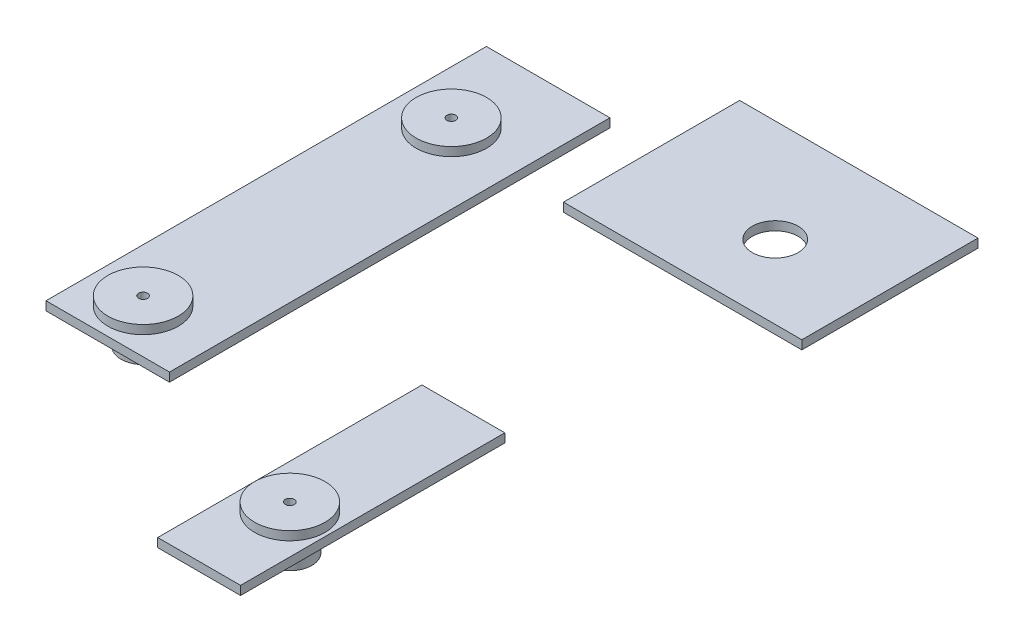
ISO-10303-21;
HEADER;
FILE_DESCRIPTION(('STEP AP214'),'2;1');
FILE_NAME('part.step','',(''),(''),'','','');
FILE_SCHEMA(('AUTOMOTIVE_DESIGN { 1 0 10303 214 1 1 1 1 }'));
ENDSEC;
DATA;
#1=APPLICATION_CONTEXT('core data for automotive mechanical design processes');
#2=APPLICATION_PROTOCOL_DEFINITION('international standard','automotive_design',2000,#1);
#3=PRODUCT_CONTEXT('',#1,'mechanical');
#4=PRODUCT('Part','Part','',(#3));
#5=PRODUCT_RELATED_PRODUCT_CATEGORY('part','',(#4));
#6=PRODUCT_DEFINITION_FORMATION('','',#4);
#7=PRODUCT_DEFINITION_CONTEXT('part definition',#1,'design');
#8=PRODUCT_DEFINITION('design','',#6,#7);
#9=PRODUCT_DEFINITION_SHAPE('','',#8);
#10=(LENGTH_UNIT() NAMED_UNIT(*) SI_UNIT(.MILLI.,.METRE.));
#11=(NAMED_UNIT(*) PLANE_ANGLE_UNIT() SI_UNIT($,.RADIAN.));
#12=(NAMED_UNIT(*) SI_UNIT($,.STERADIAN.) SOLID_ANGLE_UNIT());
#13=UNCERTAINTY_MEASURE_WITH_UNIT(LENGTH_MEASURE(1.E-05),#10,'distance_accuracy_value','');
#14=(GEOMETRIC_REPRESENTATION_CONTEXT(3) GLOBAL_UNCERTAINTY_ASSIGNED_CONTEXT((#13)) GLOBAL_UNIT_ASSIGNED_CONTEXT((#10,
#11,#12)) REPRESENTATION_CONTEXT('',''));
#15=CARTESIAN_POINT('',(0.,0.,0.));
#16=DIRECTION('',(0.,0.,1.));
#17=DIRECTION('',(1.,0.,0.));
#18=AXIS2_PLACEMENT_3D('',#15,#16,#17);
#19=CARTESIAN_POINT('',(-109.077805773511,45.2153525162861,-150.000000000001));
#20=DIRECTION('',(0.,1.,0.));
#21=DIRECTION('',(0.,0.,1.));
#22=AXIS2_PLACEMENT_3D('',#19,#20,#21);
#23=PLANE('',#22);
#24=CARTESIAN_POINT('',(-109.077805773511,45.2153525162861,-150.000000000001));
#25=DIRECTION('',(0.,1.,0.));
#26=DIRECTION('',(0.,0.,1.));
#27=AXIS2_PLACEMENT_3D('',#24,#25,#26);
#28=CIRCLE('',#27,5.09999999999999);
#29=CARTESIAN_POINT('',(-109.077805773511,45.2153525162862,-144.900000000001));
#30=VERTEX_POINT('',#29);
#31=EDGE_CURVE('E67',#30,#30,#28,.T.);
#32=ORIENTED_EDGE('',*,*,#31,.T.);
#33=EDGE_LOOP('',(#32));
#34=FACE_BOUND('',#33,.T.);
#35=CARTESIAN_POINT('',(-109.077805773511,45.2153525162861,-150.000000000001));
#36=DIRECTION('',(0.,-1.,0.));
#37=DIRECTION('',(0.,0.,-1.));
#38=AXIS2_PLACEMENT_3D('',#35,#36,#37);
#39=CIRCLE('',#38,25.);
#40=CARTESIAN_POINT('',(-109.077805773511,45.2153525162861,-175.000000000001));
#41=VERTEX_POINT('',#40);
#42=EDGE_CURVE('E11',#41,#41,#39,.T.);
#43=ORIENTED_EDGE('',*,*,#42,.T.);
#44=EDGE_LOOP('',(#43));
#45=FACE_BOUND('',#44,.T.);
#46=ADVANCED_FACE('F48',(#34,#45),#23,.F.);
#47=CARTESIAN_POINT('',(-109.077805773511,45.2153525162862,-150.000000000001));
#48=DIRECTION('',(0.,-1.,0.));
#49=DIRECTION('',(0.,0.,-1.));
#50=AXIS2_PLACEMENT_3D('',#47,#48,#49);
#51=CYLINDRICAL_SURFACE('',#50,25.);
#52=ORIENTED_EDGE('',*,*,#42,.F.);
#53=EDGE_LOOP('',(#52));
#54=FACE_BOUND('',#53,.T.);
#55=CARTESIAN_POINT('',(-109.077805773511,85.2153525162861,-150.000000000001));
#56=DIRECTION('',(0.,-1.,0.));
#57=DIRECTION('',(0.,0.,-1.));
#58=AXIS2_PLACEMENT_3D('',#55,#56,#57);
#59=CIRCLE('',#58,25.);
#60=CARTESIAN_POINT('',(-109.077805773511,85.215352516286,-175.000000000001));
#61=VERTEX_POINT('',#60);
#62=EDGE_CURVE('E54',#61,#61,#59,.T.);
#63=ORIENTED_EDGE('',*,*,#62,.T.);
#64=EDGE_LOOP('',(#63));
#65=FACE_BOUND('',#64,.T.);
#66=ADVANCED_FACE('F91',(#54,#65),#51,.T.);
#67=CARTESIAN_POINT('',(-109.077805773511,85.2153525162861,-125.000000000001));
#68=DIRECTION('',(0.,1.,0.));
#69=DIRECTION('',(0.,0.,1.));
#70=AXIS2_PLACEMENT_3D('',#67,#68,#69);
#71=PLANE('',#70);
#72=ORIENTED_EDGE('',*,*,#62,.F.);
#73=EDGE_LOOP('',(#72));
#74=FACE_BOUND('',#73,.T.);
#75=CARTESIAN_POINT('',(-109.077805773511,85.2153525162861,-150.000000000001));
#76=DIRECTION('',(0.,-1.,0.));
#77=DIRECTION('',(0.,0.,-1.));
#78=AXIS2_PLACEMENT_3D('',#75,#76,#77);
#79=CIRCLE('',#78,40.);
#80=CARTESIAN_POINT('',(-109.077805773511,85.215352516286,-190.000000000001));
#81=VERTEX_POINT('',#80);
#82=EDGE_CURVE('E58',#81,#81,#79,.T.);
#83=ORIENTED_EDGE('',*,*,#82,.T.);
#84=EDGE_LOOP('',(#83));
#85=FACE_BOUND('',#84,.T.);
#86=ADVANCED_FACE('F85',(#74,#85),#71,.F.);
#87=CARTESIAN_POINT('',(-109.077805773511,45.2153525162862,-150.000000000001));
#88=DIRECTION('',(0.,-1.,0.));
#89=DIRECTION('',(0.,0.,-1.));
#90=AXIS2_PLACEMENT_3D('',#87,#88,#89);
#91=CYLINDRICAL_SURFACE('',#90,40.);
#92=ORIENTED_EDGE('',*,*,#82,.F.);
#93=EDGE_LOOP('',(#92));
#94=FACE_BOUND('',#93,.T.);
#95=CARTESIAN_POINT('',(-109.077805773511,95.2153525162861,-150.000000000001));
#96=DIRECTION('',(0.,-1.,0.));
#97=DIRECTION('',(0.,0.,-1.));
#98=AXIS2_PLACEMENT_3D('',#95,#96,#97);
#99=CIRCLE('',#98,40.);
#100=CARTESIAN_POINT('',(-109.077805773511,95.215352516286,-190.000000000001));
#101=VERTEX_POINT('',#100);
#102=EDGE_CURVE('E62',#101,#101,#99,.T.);
#103=ORIENTED_EDGE('',*,*,#102,.T.);
#104=EDGE_LOOP('',(#103));
#105=FACE_BOUND('',#104,.T.);
#106=ADVANCED_FACE('F80',(#94,#105),#91,.T.);
#107=CARTESIAN_POINT('',(-109.077805773511,95.2153525162862,-110.000000000001));
#108=DIRECTION('',(0.,-1.,0.));
#109=DIRECTION('',(0.,0.,-1.));
#110=AXIS2_PLACEMENT_3D('',#107,#108,#109);
#111=PLANE('',#110);
#112=CARTESIAN_POINT('',(-109.077805773511,95.2153525162861,-150.000000000001));
#113=DIRECTION('',(0.,1.,0.));
#114=DIRECTION('',(0.,0.,1.));
#115=AXIS2_PLACEMENT_3D('',#112,#113,#114);
#116=CIRCLE('',#115,5.09999999999999);
#117=CARTESIAN_POINT('',(-109.077805773511,95.2153525162861,-144.900000000001));
#118=VERTEX_POINT('',#117);
#119=EDGE_CURVE('E70',#118,#118,#116,.T.);
#120=ORIENTED_EDGE('',*,*,#119,.F.);
#121=EDGE_LOOP('',(#120));
#122=FACE_BOUND('',#121,.T.);
#123=ORIENTED_EDGE('',*,*,#102,.F.);
#124=EDGE_LOOP('',(#123));
#125=FACE_BOUND('',#124,.T.);
#126=ADVANCED_FACE('F77',(#122,#125),#111,.F.);
#127=CARTESIAN_POINT('',(-109.077805773511,95.2153525162861,-150.000000000001));
#128=DIRECTION('',(0.,1.,0.));
#129=DIRECTION('',(0.,0.,1.));
#130=AXIS2_PLACEMENT_3D('',#127,#128,#129);
#131=CYLINDRICAL_SURFACE('',#130,5.09999999999999);
#132=ORIENTED_EDGE('',*,*,#119,.T.);
#133=EDGE_LOOP('',(#132));
#134=FACE_BOUND('',#133,.T.);
#135=ORIENTED_EDGE('',*,*,#31,.F.);
#136=EDGE_LOOP('',(#135));
#137=FACE_BOUND('',#136,.T.);
#138=ADVANCED_FACE('F74',(#134,#137),#131,.F.);
#139=CLOSED_SHELL('',(#46,#66,#86,#106,#126,#138));
#140=MANIFOLD_SOLID_BREP('B2',#139);
#141=CARTESIAN_POINT('',(-6.59194920871187E-13,-74.1841666666663,200.));
#142=DIRECTION('',(0.,-1.,0.));
#143=DIRECTION('',(1.,0.,0.));
#144=AXIS2_PLACEMENT_3D('',#141,#142,#143);
#145=PLANE('',#144);
#146=CARTESIAN_POINT('',(57.5251309112952,-74.1841666666671,200.));
#147=DIRECTION('',(0.,1.,0.));
#148=DIRECTION('',(0.,0.,1.));
#149=AXIS2_PLACEMENT_3D('',#146,#147,#148);
#150=CIRCLE('',#149,5.09999999999997);
#151=CARTESIAN_POINT('',(57.5251309112952,-74.1841666666671,205.1));
#152=VERTEX_POINT('',#151);
#153=EDGE_CURVE('E168',#152,#152,#150,.T.);
#154=ORIENTED_EDGE('',*,*,#153,.T.);
#155=EDGE_LOOP('',(#154));
#156=FACE_BOUND('',#155,.T.);
#157=CARTESIAN_POINT('',(57.5251309112946,-74.1841666666669,200.));
#158=DIRECTION('',(0.,-1.,0.));
#159=DIRECTION('',(1.,0.,0.));
#160=AXIS2_PLACEMENT_3D('',#157,#158,#159);
#161=CIRCLE('',#160,25.);
#162=CARTESIAN_POINT('',(82.5251309112947,-74.1841666666672,200.));
#163=VERTEX_POINT('',#162);
#164=EDGE_CURVE('E163',#163,#163,#161,.T.);
#165=ORIENTED_EDGE('',*,*,#164,.T.);
#166=EDGE_LOOP('',(#165));
#167=FACE_BOUND('',#166,.T.);
#168=ADVANCED_FACE('F149',(#156,#167),#145,.T.);
#169=CARTESIAN_POINT('',(-2.35922392732846E-13,-24.1841666666663,200.));
#170=DIRECTION('',(0.,1.,0.));
#171=DIRECTION('',(-1.,0.,0.));
#172=AXIS2_PLACEMENT_3D('',#169,#170,#171);
#173=PLANE('',#172);
#174=CARTESIAN_POINT('',(57.5251309112952,-24.1841666666669,200.));
#175=DIRECTION('',(0.,1.,0.));
#176=DIRECTION('',(0.,0.,1.));
#177=AXIS2_PLACEMENT_3D('',#174,#175,#176);
#178=CIRCLE('',#177,5.09999999999999);
#179=CARTESIAN_POINT('',(57.5251309112952,-24.1841666666669,205.1));
#180=VERTEX_POINT('',#179);
#181=EDGE_CURVE('E171',#180,#180,#178,.T.);
#182=ORIENTED_EDGE('',*,*,#181,.F.);
#183=EDGE_LOOP('',(#182));
#184=FACE_BOUND('',#183,.T.);
#185=CARTESIAN_POINT('',(57.5251309112952,-24.184166666667,200.));
#186=DIRECTION('',(0.,-1.,0.));
#187=DIRECTION('',(1.,0.,0.));
#188=AXIS2_PLACEMENT_3D('',#185,#186,#187);
#189=CIRCLE('',#188,40.);
#190=CARTESIAN_POINT('',(97.5251309112952,-24.1841666666674,200.));
#191=VERTEX_POINT('',#190);
#192=EDGE_CURVE('E47',#191,#191,#189,.T.);
#193=ORIENTED_EDGE('',*,*,#192,.F.);
#194=EDGE_LOOP('',(#193));
#195=FACE_BOUND('',#194,.T.);
#196=ADVANCED_FACE('F177',(#184,#195),#173,.T.);
#197=CARTESIAN_POINT('',(57.5251309112946,-74.1841666666669,200.));
#198=DIRECTION('',(0.,-1.,0.));
#199=DIRECTION('',(1.,0.,0.));
#200=AXIS2_PLACEMENT_3D('',#197,#198,#199);
#201=CYLINDRICAL_SURFACE('',#200,40.);
#202=ORIENTED_EDGE('',*,*,#192,.T.);
#203=EDGE_LOOP('',(#202));
#204=FACE_BOUND('',#203,.T.);
#205=CARTESIAN_POINT('',(57.5251309112951,-34.184166666667,200.));
#206=DIRECTION('',(0.,-1.,0.));
#207=DIRECTION('',(1.,0.,0.));
#208=AXIS2_PLACEMENT_3D('',#205,#206,#207);
#209=CIRCLE('',#208,40.);
#210=CARTESIAN_POINT('',(97.5251309112951,-34.1841666666674,200.));
#211=VERTEX_POINT('',#210);
#212=EDGE_CURVE('E155',#211,#211,#209,.T.);
#213=ORIENTED_EDGE('',*,*,#212,.F.);
#214=EDGE_LOOP('',(#213));
#215=FACE_BOUND('',#214,.T.);
#216=ADVANCED_FACE('F180',(#204,#215),#201,.T.);
#217=CARTESIAN_POINT('',(-3.81639164714898E-13,-34.1841666666663,200.));
#218=DIRECTION('',(0.,-1.,0.));
#219=DIRECTION('',(1.,0.,0.));
#220=AXIS2_PLACEMENT_3D('',#217,#218,#219);
#221=PLANE('',#220);
#222=ORIENTED_EDGE('',*,*,#212,.T.);
#223=EDGE_LOOP('',(#222));
#224=FACE_BOUND('',#223,.T.);
#225=CARTESIAN_POINT('',(57.5251309112951,-34.184166666667,200.));
#226=DIRECTION('',(0.,-1.,0.));
#227=DIRECTION('',(1.,0.,0.));
#228=AXIS2_PLACEMENT_3D('',#225,#226,#227);
#229=CIRCLE('',#228,25.);
#230=CARTESIAN_POINT('',(82.5251309112951,-34.1841666666672,200.));
#231=VERTEX_POINT('',#230);
#232=EDGE_CURVE('E159',#231,#231,#229,.T.);
#233=ORIENTED_EDGE('',*,*,#232,.F.);
#234=EDGE_LOOP('',(#233));
#235=FACE_BOUND('',#234,.T.);
#236=ADVANCED_FACE('F185',(#224,#235),#221,.T.);
#237=CARTESIAN_POINT('',(57.5251309112946,-74.1841666666669,200.));
#238=DIRECTION('',(0.,-1.,0.));
#239=DIRECTION('',(1.,0.,0.));
#240=AXIS2_PLACEMENT_3D('',#237,#238,#239);
#241=CYLINDRICAL_SURFACE('',#240,25.);
#242=ORIENTED_EDGE('',*,*,#232,.T.);
#243=EDGE_LOOP('',(#242));
#244=FACE_BOUND('',#243,.T.);
#245=ORIENTED_EDGE('',*,*,#164,.F.);
#246=EDGE_LOOP('',(#245));
#247=FACE_BOUND('',#246,.T.);
#248=ADVANCED_FACE('F191',(#244,#247),#241,.T.);
#249=CARTESIAN_POINT('',(57.5251309112952,-24.1841666666669,200.));
#250=DIRECTION('',(0.,1.,0.));
#251=DIRECTION('',(0.,0.,1.));
#252=AXIS2_PLACEMENT_3D('',#249,#250,#251);
#253=CYLINDRICAL_SURFACE('',#252,5.09999999999998);
#254=ORIENTED_EDGE('',*,*,#153,.F.);
#255=EDGE_LOOP('',(#254));
#256=FACE_BOUND('',#255,.T.);
#257=ORIENTED_EDGE('',*,*,#181,.T.);
#258=EDGE_LOOP('',(#257));
#259=FACE_BOUND('',#258,.T.);
#260=ADVANCED_FACE('F175',(#256,#259),#253,.F.);
#261=CLOSED_SHELL('',(#168,#196,#216,#236,#248,#260));
#262=MANIFOLD_SOLID_BREP('B6',#261);
#263=CARTESIAN_POINT('',(4.02455846426619E-13,45.2153525162862,200.));
#264=DIRECTION('',(0.,1.,0.));
#265=DIRECTION('',(0.,0.,1.));
#266=AXIS2_PLACEMENT_3D('',#263,#264,#265);
#267=PLANE('',#266);
#268=CARTESIAN_POINT('',(-109.077805773511,45.2153525162862,200.));
#269=DIRECTION('',(0.,1.,0.));
#270=DIRECTION('',(0.,0.,1.));
#271=AXIS2_PLACEMENT_3D('',#268,#269,#270);
#272=CIRCLE('',#271,5.09999999999999);
#273=CARTESIAN_POINT('',(-109.077805773511,45.2153525162862,205.1));
#274=VERTEX_POINT('',#273);
#275=EDGE_CURVE('E273',#274,#274,#272,.T.);
#276=ORIENTED_EDGE('',*,*,#275,.T.);
#277=EDGE_LOOP('',(#276));
#278=FACE_BOUND('',#277,.T.);
#279=CARTESIAN_POINT('',(-109.077805773511,45.2153525162863,200.));
#280=DIRECTION('',(0.,1.,0.));
#281=DIRECTION('',(0.,0.,1.));
#282=AXIS2_PLACEMENT_3D('',#279,#280,#281);
#283=CIRCLE('',#282,25.);
#284=CARTESIAN_POINT('',(-109.077805773511,45.2153525162863,225.));
#285=VERTEX_POINT('',#284);
#286=EDGE_CURVE('E268',#285,#285,#283,.T.);
#287=ORIENTED_EDGE('',*,*,#286,.F.);
#288=EDGE_LOOP('',(#287));
#289=FACE_BOUND('',#288,.T.);
#290=ADVANCED_FACE('F254',(#278,#289),#267,.F.);
#291=CARTESIAN_POINT('',(9.29811783123569E-13,95.2153525162862,200.));
#292=DIRECTION('',(0.,-1.,0.));
#293=DIRECTION('',(0.,0.,-1.));
#294=AXIS2_PLACEMENT_3D('',#291,#292,#293);
#295=PLANE('',#294);
#296=CARTESIAN_POINT('',(-109.077805773511,95.2153525162862,200.));
#297=DIRECTION('',(0.,1.,0.));
#298=DIRECTION('',(0.,0.,1.));
#299=AXIS2_PLACEMENT_3D('',#296,#297,#298);
#300=CIRCLE('',#299,5.09999999999999);
#301=CARTESIAN_POINT('',(-109.077805773511,95.2153525162862,205.1));
#302=VERTEX_POINT('',#301);
#303=EDGE_CURVE('E276',#302,#302,#300,.T.);
#304=ORIENTED_EDGE('',*,*,#303,.F.);
#305=EDGE_LOOP('',(#304));
#306=FACE_BOUND('',#305,.T.);
#307=CARTESIAN_POINT('',(-109.077805773511,95.2153525162864,200.));
#308=DIRECTION('',(0.,1.,0.));
#309=DIRECTION('',(0.,0.,1.));
#310=AXIS2_PLACEMENT_3D('',#307,#308,#309);
#311=CIRCLE('',#310,39.9999999999994);
#312=CARTESIAN_POINT('',(-109.077805773511,95.2153525162864,239.999999999999));
#313=VERTEX_POINT('',#312);
#314=EDGE_CURVE('E148',#313,#313,#311,.T.);
#315=ORIENTED_EDGE('',*,*,#314,.T.);
#316=EDGE_LOOP('',(#315));
#317=FACE_BOUND('',#316,.T.);
#318=ADVANCED_FACE('F283',(#306,#317),#295,.F.);
#319=CARTESIAN_POINT('',(-109.077805773511,85.2153525162862,200.));
#320=DIRECTION('',(0.,1.,0.));
#321=DIRECTION('',(0.,0.,1.));
#322=AXIS2_PLACEMENT_3D('',#319,#320,#321);
#323=CYLINDRICAL_SURFACE('',#322,39.9999999999995);
#324=ORIENTED_EDGE('',*,*,#314,.F.);
#325=EDGE_LOOP('',(#324));
#326=FACE_BOUND('',#325,.T.);
#327=CARTESIAN_POINT('',(-109.077805773511,85.2153525162864,200.));
#328=DIRECTION('',(0.,1.,0.));
#329=DIRECTION('',(0.,0.,1.));
#330=AXIS2_PLACEMENT_3D('',#327,#328,#329);
#331=CIRCLE('',#330,39.9999999999996);
#332=CARTESIAN_POINT('',(-109.077805773511,85.2153525162864,240.));
#333=VERTEX_POINT('',#332);
#334=EDGE_CURVE('E260',#333,#333,#331,.T.);
#335=ORIENTED_EDGE('',*,*,#334,.T.);
#336=EDGE_LOOP('',(#335));
#337=FACE_BOUND('',#336,.T.);
#338=ADVANCED_FACE('F285',(#326,#337),#323,.T.);
#339=CARTESIAN_POINT('',(9.43689570931383E-13,85.2153525162863,200.));
#340=DIRECTION('',(0.,1.,0.));
#341=DIRECTION('',(0.,0.,1.));
#342=AXIS2_PLACEMENT_3D('',#339,#340,#341);
#343=PLANE('',#342);
#344=ORIENTED_EDGE('',*,*,#334,.F.);
#345=EDGE_LOOP('',(#344));
#346=FACE_BOUND('',#345,.T.);
#347=CARTESIAN_POINT('',(-109.077805773511,85.2153525162863,200.));
#348=DIRECTION('',(0.,1.,0.));
#349=DIRECTION('',(0.,0.,1.));
#350=AXIS2_PLACEMENT_3D('',#347,#348,#349);
#351=CIRCLE('',#350,24.9999999999995);
#352=CARTESIAN_POINT('',(-109.077805773511,85.2153525162863,225.));
#353=VERTEX_POINT('',#352);
#354=EDGE_CURVE('E264',#353,#353,#351,.T.);
#355=ORIENTED_EDGE('',*,*,#354,.T.);
#356=EDGE_LOOP('',(#355));
#357=FACE_BOUND('',#356,.T.);
#358=ADVANCED_FACE('F290',(#346,#357),#343,.F.);
#359=CARTESIAN_POINT('',(-109.077805773511,85.2153525162862,200.));
#360=DIRECTION('',(0.,1.,0.));
#361=DIRECTION('',(0.,0.,1.));
#362=AXIS2_PLACEMENT_3D('',#359,#360,#361);
#363=CYLINDRICAL_SURFACE('',#362,24.9999999999998);
#364=ORIENTED_EDGE('',*,*,#354,.F.);
#365=EDGE_LOOP('',(#364));
#366=FACE_BOUND('',#365,.T.);
#367=ORIENTED_EDGE('',*,*,#286,.T.);
#368=EDGE_LOOP('',(#367));
#369=FACE_BOUND('',#368,.T.);
#370=ADVANCED_FACE('F297',(#366,#369),#363,.T.);
#371=CARTESIAN_POINT('',(-109.077805773511,95.2153525162862,200.));
#372=DIRECTION('',(0.,1.,0.));
#373=DIRECTION('',(0.,0.,1.));
#374=AXIS2_PLACEMENT_3D('',#371,#372,#373);
#375=CYLINDRICAL_SURFACE('',#374,5.09999999999999);
#376=ORIENTED_EDGE('',*,*,#303,.T.);
#377=EDGE_LOOP('',(#376));
#378=FACE_BOUND('',#377,.T.);
#379=ORIENTED_EDGE('',*,*,#275,.F.);
#380=EDGE_LOOP('',(#379));
#381=FACE_BOUND('',#380,.T.);
#382=ADVANCED_FACE('F280',(#378,#381),#375,.F.);
#383=CLOSED_SHELL('',(#290,#318,#338,#358,#370,#382));
#384=MANIFOLD_SOLID_BREP('B42',#383);
#385=CARTESIAN_POINT('',(268.195509943439,315.915173578323,100.));
#386=DIRECTION('',(0.,1.,0.));
#387=DIRECTION('',(0.,0.,1.));
#388=AXIS2_PLACEMENT_3D('',#385,#386,#387);
#389=PLANE('',#388);
#390=CARTESIAN_POINT('',(425.006556805499,315.915173578323,16.4302576927184));
#391=DIRECTION('',(0.,1.,0.));
#392=DIRECTION('',(0.,0.,1.));
#393=AXIS2_PLACEMENT_3D('',#390,#391,#392);
#394=CIRCLE('',#393,25.9999999999999);
#395=CARTESIAN_POINT('',(425.006556805499,315.915173578323,42.4302576927184));
#396=VERTEX_POINT('',#395);
#397=EDGE_CURVE('E424',#396,#396,#394,.T.);
#398=ORIENTED_EDGE('',*,*,#397,.T.);
#399=EDGE_LOOP('',(#398));
#400=FACE_BOUND('',#399,.T.);
#401=DIRECTION('',(1.,0.,0.));
#402=VECTOR('',#401,1.);
#403=CARTESIAN_POINT('',(268.195509943439,315.915173578323,-100.));
#404=LINE('',#403,#402);
#405=CARTESIAN_POINT('',(268.195509943439,315.915173578323,-100.));
#406=VERTEX_POINT('',#405);
#407=CARTESIAN_POINT('',(538.815556412828,315.915173578323,-100.));
#408=VERTEX_POINT('',#407);
#409=EDGE_CURVE('E422',#406,#408,#404,.T.);
#410=ORIENTED_EDGE('',*,*,#409,.T.);
#411=DIRECTION('',(0.,0.,-1.));
#412=VECTOR('',#411,1.);
#413=CARTESIAN_POINT('',(538.815556412828,315.915173578323,100.));
#414=LINE('',#413,#412);
#415=CARTESIAN_POINT('',(538.815556412828,315.915173578323,100.));
#416=VERTEX_POINT('',#415);
#417=EDGE_CURVE('E252',#416,#408,#414,.T.);
#418=ORIENTED_EDGE('',*,*,#417,.F.);
#419=DIRECTION('',(1.,0.,0.));
#420=VECTOR('',#419,1.);
#421=CARTESIAN_POINT('',(268.195509943439,315.915173578323,100.));
#422=LINE('',#421,#420);
#423=CARTESIAN_POINT('',(268.195509943439,315.915173578323,100.));
#424=VERTEX_POINT('',#423);
#425=EDGE_CURVE('E399',#424,#416,#422,.T.);
#426=ORIENTED_EDGE('',*,*,#425,.F.);
#427=DIRECTION('',(0.,0.,-1.));
#428=VECTOR('',#427,1.);
#429=CARTESIAN_POINT('',(268.195509943439,315.915173578323,100.));
#430=LINE('',#429,#428);
#431=EDGE_CURVE('E375',#424,#406,#430,.T.);
#432=ORIENTED_EDGE('',*,*,#431,.T.);
#433=EDGE_LOOP('',(#410,#418,#426,#432));
#434=FACE_BOUND('',#433,.T.);
#435=ADVANCED_FACE('F359',(#400,#434),#389,.F.);
#436=CARTESIAN_POINT('',(538.815556412828,325.915173578323,100.));
#437=DIRECTION('',(1.,0.,0.));
#438=DIRECTION('',(0.,0.,-1.));
#439=AXIS2_PLACEMENT_3D('',#436,#437,#438);
#440=PLANE('',#439);
#441=DIRECTION('',(0.,-1.,0.));
#442=VECTOR('',#441,1.);
#443=CARTESIAN_POINT('',(538.815556412828,325.915173578323,-100.));
#444=LINE('',#443,#442);
#445=CARTESIAN_POINT('',(538.815556412828,325.915173578323,-100.));
#446=VERTEX_POINT('',#445);
#447=EDGE_CURVE('E408',#446,#408,#444,.T.);
#448=ORIENTED_EDGE('',*,*,#447,.F.);
#449=DIRECTION('',(0.,0.,-1.));
#450=VECTOR('',#449,1.);
#451=CARTESIAN_POINT('',(538.815556412828,325.915173578323,100.));
#452=LINE('',#451,#450);
#453=CARTESIAN_POINT('',(538.815556412828,325.915173578323,100.));
#454=VERTEX_POINT('',#453);
#455=EDGE_CURVE('E367',#454,#446,#452,.T.);
#456=ORIENTED_EDGE('',*,*,#455,.F.);
#457=DIRECTION('',(0.,-1.,0.));
#458=VECTOR('',#457,1.);
#459=CARTESIAN_POINT('',(538.815556412828,325.915173578323,100.));
#460=LINE('',#459,#458);
#461=EDGE_CURVE('E406',#454,#416,#460,.T.);
#462=ORIENTED_EDGE('',*,*,#461,.T.);
#463=ORIENTED_EDGE('',*,*,#417,.T.);
#464=EDGE_LOOP('',(#448,#456,#462,#463));
#465=FACE_BOUND('',#464,.T.);
#466=ADVANCED_FACE('F405',(#465),#440,.T.);
#467=CARTESIAN_POINT('',(268.195509943439,325.915173578323,100.));
#468=DIRECTION('',(0.,1.,0.));
#469=DIRECTION('',(0.,0.,1.));
#470=AXIS2_PLACEMENT_3D('',#467,#468,#469);
#471=PLANE('',#470);
#472=CARTESIAN_POINT('',(425.006556805499,325.915173578323,16.4302576927184));
#473=DIRECTION('',(0.,1.,0.));
#474=DIRECTION('',(0.,0.,1.));
#475=AXIS2_PLACEMENT_3D('',#472,#473,#474);
#476=CIRCLE('',#475,26.);
#477=CARTESIAN_POINT('',(425.006556805499,325.915173578323,42.4302576927184));
#478=VERTEX_POINT('',#477);
#479=EDGE_CURVE('E436',#478,#478,#476,.T.);
#480=ORIENTED_EDGE('',*,*,#479,.F.);
#481=EDGE_LOOP('',(#480));
#482=FACE_BOUND('',#481,.T.);
#483=DIRECTION('',(1.,0.,0.));
#484=VECTOR('',#483,1.);
#485=CARTESIAN_POINT('',(268.195509943439,325.915173578323,-100.));
#486=LINE('',#485,#484);
#487=CARTESIAN_POINT('',(268.195509943439,325.915173578323,-100.));
#488=VERTEX_POINT('',#487);
#489=EDGE_CURVE('E426',#488,#446,#486,.T.);
#490=ORIENTED_EDGE('',*,*,#489,.F.);
#491=DIRECTION('',(0.,0.,-1.));
#492=VECTOR('',#491,1.);
#493=CARTESIAN_POINT('',(268.195509943439,325.915173578323,100.));
#494=LINE('',#493,#492);
#495=CARTESIAN_POINT('',(268.195509943439,325.915173578323,100.));
#496=VERTEX_POINT('',#495);
#497=EDGE_CURVE('E388',#496,#488,#494,.T.);
#498=ORIENTED_EDGE('',*,*,#497,.F.);
#499=DIRECTION('',(1.,0.,0.));
#500=VECTOR('',#499,1.);
#501=CARTESIAN_POINT('',(268.195509943439,325.915173578323,100.));
#502=LINE('',#501,#500);
#503=EDGE_CURVE('E414',#496,#454,#502,.T.);
#504=ORIENTED_EDGE('',*,*,#503,.T.);
#505=ORIENTED_EDGE('',*,*,#455,.T.);
#506=EDGE_LOOP('',(#490,#498,#504,#505));
#507=FACE_BOUND('',#506,.T.);
#508=ADVANCED_FACE('F416',(#482,#507),#471,.T.);
#509=CARTESIAN_POINT('',(268.195509943439,315.915173578323,100.));
#510=DIRECTION('',(-1.,0.,0.));
#511=DIRECTION('',(0.,0.,1.));
#512=AXIS2_PLACEMENT_3D('',#509,#510,#511);
#513=PLANE('',#512);
#514=DIRECTION('',(0.,1.,0.));
#515=VECTOR('',#514,1.);
#516=CARTESIAN_POINT('',(268.195509943439,315.915173578323,-100.));
#517=LINE('',#516,#515);
#518=EDGE_CURVE('E428',#406,#488,#517,.T.);
#519=ORIENTED_EDGE('',*,*,#518,.F.);
#520=ORIENTED_EDGE('',*,*,#431,.F.);
#521=DIRECTION('',(0.,1.,0.));
#522=VECTOR('',#521,1.);
#523=CARTESIAN_POINT('',(268.195509943439,315.915173578323,100.));
#524=LINE('',#523,#522);
#525=EDGE_CURVE('E417',#424,#496,#524,.T.);
#526=ORIENTED_EDGE('',*,*,#525,.T.);
#527=ORIENTED_EDGE('',*,*,#497,.T.);
#528=EDGE_LOOP('',(#519,#520,#526,#527));
#529=FACE_BOUND('',#528,.T.);
#530=ADVANCED_FACE('F444',(#529),#513,.T.);
#531=CARTESIAN_POINT('',(0.,0.,100.));
#532=DIRECTION('',(0.,0.,-1.));
#533=DIRECTION('',(-1.,0.,0.));
#534=AXIS2_PLACEMENT_3D('',#531,#532,#533);
#535=PLANE('',#534);
#536=ORIENTED_EDGE('',*,*,#425,.T.);
#537=ORIENTED_EDGE('',*,*,#461,.F.);
#538=ORIENTED_EDGE('',*,*,#503,.F.);
#539=ORIENTED_EDGE('',*,*,#525,.F.);
#540=EDGE_LOOP('',(#536,#537,#538,#539));
#541=FACE_BOUND('',#540,.T.);
#542=ADVANCED_FACE('F413',(#541),#535,.F.);
#543=CARTESIAN_POINT('',(0.,0.,-100.));
#544=DIRECTION('',(0.,0.,-1.));
#545=DIRECTION('',(-1.,0.,0.));
#546=AXIS2_PLACEMENT_3D('',#543,#544,#545);
#547=PLANE('',#546);
#548=ORIENTED_EDGE('',*,*,#409,.F.);
#549=ORIENTED_EDGE('',*,*,#518,.T.);
#550=ORIENTED_EDGE('',*,*,#489,.T.);
#551=ORIENTED_EDGE('',*,*,#447,.T.);
#552=EDGE_LOOP('',(#548,#549,#550,#551));
#553=FACE_BOUND('',#552,.T.);
#554=ADVANCED_FACE('F456',(#553),#547,.T.);
#555=CARTESIAN_POINT('',(425.006556805499,325.915173578323,16.4302576927184));
#556=DIRECTION('',(0.,1.,0.));
#557=DIRECTION('',(0.,0.,1.));
#558=AXIS2_PLACEMENT_3D('',#555,#556,#557);
#559=CYLINDRICAL_SURFACE('',#558,25.9999999999999);
#560=ORIENTED_EDGE('',*,*,#479,.T.);
#561=EDGE_LOOP('',(#560));
#562=FACE_BOUND('',#561,.T.);
#563=ORIENTED_EDGE('',*,*,#397,.F.);
#564=EDGE_LOOP('',(#563));
#565=FACE_BOUND('',#564,.T.);
#566=ADVANCED_FACE('F440',(#562,#565),#559,.F.);
#567=CLOSED_SHELL('',(#435,#466,#508,#530,#542,#554,#566));
#568=MANIFOLD_SOLID_BREP('B143',#567);
#569=CARTESIAN_POINT('',(7.52513091129464,-44.1841666666667,300.));
#570=DIRECTION('',(0.,1.,0.));
#571=DIRECTION('',(0.,0.,1.));
#572=AXIS2_PLACEMENT_3D('',#569,#570,#571);
#573=PLANE('',#572);
#574=CARTESIAN_POINT('',(57.5251309112946,-44.1841666666667,200.));
#575=DIRECTION('',(0.,1.,0.));
#576=DIRECTION('',(0.,0.,1.));
#577=AXIS2_PLACEMENT_3D('',#574,#575,#576);
#578=CIRCLE('',#577,26.);
#579=CARTESIAN_POINT('',(57.5251309112946,-44.1841666666667,226.));
#580=VERTEX_POINT('',#579);
#581=EDGE_CURVE('E564',#580,#580,#578,.T.);
#582=ORIENTED_EDGE('',*,*,#581,.T.);
#583=EDGE_LOOP('',(#582));
#584=FACE_BOUND('',#583,.T.);
#585=DIRECTION('',(1.,0.,0.));
#586=VECTOR('',#585,1.);
#587=CARTESIAN_POINT('',(7.52513091129464,-44.1841666666667,0.));
#588=LINE('',#587,#586);
#589=CARTESIAN_POINT('',(7.52513091129464,-44.1841666666667,0.));
#590=VERTEX_POINT('',#589);
#591=CARTESIAN_POINT('',(101.595845197009,-44.1841666666667,0.));
#592=VERTEX_POINT('',#591);
#593=EDGE_CURVE('E562',#590,#592,#588,.T.);
#594=ORIENTED_EDGE('',*,*,#593,.T.);
#595=DIRECTION('',(0.,0.,-1.));
#596=VECTOR('',#595,1.);
#597=CARTESIAN_POINT('',(101.595845197009,-44.1841666666667,300.));
#598=LINE('',#597,#596);
#599=CARTESIAN_POINT('',(101.595845197009,-44.1841666666667,300.));
#600=VERTEX_POINT('',#599);
#601=EDGE_CURVE('E357',#600,#592,#598,.T.);
#602=ORIENTED_EDGE('',*,*,#601,.F.);
#603=DIRECTION('',(1.,0.,0.));
#604=VECTOR('',#603,1.);
#605=CARTESIAN_POINT('',(7.52513091129464,-44.1841666666667,300.));
#606=LINE('',#605,#604);
#607=CARTESIAN_POINT('',(7.52513091129464,-44.1841666666667,300.));
#608=VERTEX_POINT('',#607);
#609=EDGE_CURVE('E539',#608,#600,#606,.T.);
#610=ORIENTED_EDGE('',*,*,#609,.F.);
#611=DIRECTION('',(0.,0.,-1.));
#612=VECTOR('',#611,1.);
#613=CARTESIAN_POINT('',(7.52513091129464,-44.1841666666667,300.));
#614=LINE('',#613,#612);
#615=EDGE_CURVE('E515',#608,#590,#614,.T.);
#616=ORIENTED_EDGE('',*,*,#615,.T.);
#617=EDGE_LOOP('',(#594,#602,#610,#616));
#618=FACE_BOUND('',#617,.T.);
#619=ADVANCED_FACE('F499',(#584,#618),#573,.F.);
#620=CARTESIAN_POINT('',(101.595845197009,-34.1841666666667,300.));
#621=DIRECTION('',(1.,0.,0.));
#622=DIRECTION('',(0.,0.,-1.));
#623=AXIS2_PLACEMENT_3D('',#620,#621,#622);
#624=PLANE('',#623);
#625=DIRECTION('',(0.,-1.,0.));
#626=VECTOR('',#625,1.);
#627=CARTESIAN_POINT('',(101.595845197009,-34.1841666666667,0.));
#628=LINE('',#627,#626);
#629=CARTESIAN_POINT('',(101.595845197009,-34.1841666666667,0.));
#630=VERTEX_POINT('',#629);
#631=EDGE_CURVE('E548',#630,#592,#628,.T.);
#632=ORIENTED_EDGE('',*,*,#631,.F.);
#633=DIRECTION('',(0.,0.,-1.));
#634=VECTOR('',#633,1.);
#635=CARTESIAN_POINT('',(101.595845197009,-34.1841666666667,300.));
#636=LINE('',#635,#634);
#637=CARTESIAN_POINT('',(101.595845197009,-34.1841666666667,300.));
#638=VERTEX_POINT('',#637);
#639=EDGE_CURVE('E507',#638,#630,#636,.T.);
#640=ORIENTED_EDGE('',*,*,#639,.F.);
#641=DIRECTION('',(0.,-1.,0.));
#642=VECTOR('',#641,1.);
#643=CARTESIAN_POINT('',(101.595845197009,-34.1841666666667,300.));
#644=LINE('',#643,#642);
#645=EDGE_CURVE('E546',#638,#600,#644,.T.);
#646=ORIENTED_EDGE('',*,*,#645,.T.);
#647=ORIENTED_EDGE('',*,*,#601,.T.);
#648=EDGE_LOOP('',(#632,#640,#646,#647));
#649=FACE_BOUND('',#648,.T.);
#650=ADVANCED_FACE('F545',(#649),#624,.T.);
#651=CARTESIAN_POINT('',(7.52513091129464,-34.1841666666667,300.));
#652=DIRECTION('',(0.,1.,0.));
#653=DIRECTION('',(0.,0.,1.));
#654=AXIS2_PLACEMENT_3D('',#651,#652,#653);
#655=PLANE('',#654);
#656=CARTESIAN_POINT('',(57.5251309112946,-34.1841666666667,200.));
#657=DIRECTION('',(0.,1.,0.));
#658=DIRECTION('',(0.,0.,1.));
#659=AXIS2_PLACEMENT_3D('',#656,#657,#658);
#660=CIRCLE('',#659,26.);
#661=CARTESIAN_POINT('',(57.5251309112946,-34.1841666666667,226.));
#662=VERTEX_POINT('',#661);
#663=EDGE_CURVE('E576',#662,#662,#660,.T.);
#664=ORIENTED_EDGE('',*,*,#663,.F.);
#665=EDGE_LOOP('',(#664));
#666=FACE_BOUND('',#665,.T.);
#667=DIRECTION('',(1.,0.,0.));
#668=VECTOR('',#667,1.);
#669=CARTESIAN_POINT('',(7.52513091129464,-34.1841666666667,0.));
#670=LINE('',#669,#668);
#671=CARTESIAN_POINT('',(7.52513091129464,-34.1841666666667,0.));
#672=VERTEX_POINT('',#671);
#673=EDGE_CURVE('E566',#672,#630,#670,.T.);
#674=ORIENTED_EDGE('',*,*,#673,.F.);
#675=DIRECTION('',(0.,0.,-1.));
#676=VECTOR('',#675,1.);
#677=CARTESIAN_POINT('',(7.52513091129464,-34.1841666666667,300.));
#678=LINE('',#677,#676);
#679=CARTESIAN_POINT('',(7.52513091129464,-34.1841666666667,300.));
#680=VERTEX_POINT('',#679);
#681=EDGE_CURVE('E528',#680,#672,#678,.T.);
#682=ORIENTED_EDGE('',*,*,#681,.F.);
#683=DIRECTION('',(1.,0.,0.));
#684=VECTOR('',#683,1.);
#685=CARTESIAN_POINT('',(7.52513091129464,-34.1841666666667,300.));
#686=LINE('',#685,#684);
#687=EDGE_CURVE('E554',#680,#638,#686,.T.);
#688=ORIENTED_EDGE('',*,*,#687,.T.);
#689=ORIENTED_EDGE('',*,*,#639,.T.);
#690=EDGE_LOOP('',(#674,#682,#688,#689));
#691=FACE_BOUND('',#690,.T.);
#692=ADVANCED_FACE('F556',(#666,#691),#655,.T.);
#693=CARTESIAN_POINT('',(7.52513091129464,-44.1841666666667,300.));
#694=DIRECTION('',(-1.,0.,0.));
#695=DIRECTION('',(0.,0.,1.));
#696=AXIS2_PLACEMENT_3D('',#693,#694,#695);
#697=PLANE('',#696);
#698=DIRECTION('',(0.,1.,0.));
#699=VECTOR('',#698,1.);
#700=CARTESIAN_POINT('',(7.52513091129464,-44.1841666666667,0.));
#701=LINE('',#700,#699);
#702=EDGE_CURVE('E568',#590,#672,#701,.T.);
#703=ORIENTED_EDGE('',*,*,#702,.F.);
#704=ORIENTED_EDGE('',*,*,#615,.F.);
#705=DIRECTION('',(0.,1.,0.));
#706=VECTOR('',#705,1.);
#707=CARTESIAN_POINT('',(7.52513091129464,-44.1841666666667,300.));
#708=LINE('',#707,#706);
#709=EDGE_CURVE('E557',#608,#680,#708,.T.);
#710=ORIENTED_EDGE('',*,*,#709,.T.);
#711=ORIENTED_EDGE('',*,*,#681,.T.);
#712=EDGE_LOOP('',(#703,#704,#710,#711));
#713=FACE_BOUND('',#712,.T.);
#714=ADVANCED_FACE('F583',(#713),#697,.T.);
#715=CARTESIAN_POINT('',(0.,0.,300.));
#716=DIRECTION('',(0.,0.,-1.));
#717=DIRECTION('',(-1.,0.,0.));
#718=AXIS2_PLACEMENT_3D('',#715,#716,#717);
#719=PLANE('',#718);
#720=ORIENTED_EDGE('',*,*,#609,.T.);
#721=ORIENTED_EDGE('',*,*,#645,.F.);
#722=ORIENTED_EDGE('',*,*,#687,.F.);
#723=ORIENTED_EDGE('',*,*,#709,.F.);
#724=EDGE_LOOP('',(#720,#721,#722,#723));
#725=FACE_BOUND('',#724,.T.);
#726=ADVANCED_FACE('F553',(#725),#719,.F.);
#727=CARTESIAN_POINT('',(0.,0.,0.));
#728=DIRECTION('',(0.,0.,-1.));
#729=DIRECTION('',(-1.,0.,0.));
#730=AXIS2_PLACEMENT_3D('',#727,#728,#729);
#731=PLANE('',#730);
#732=ORIENTED_EDGE('',*,*,#593,.F.);
#733=ORIENTED_EDGE('',*,*,#702,.T.);
#734=ORIENTED_EDGE('',*,*,#673,.T.);
#735=ORIENTED_EDGE('',*,*,#631,.T.);
#736=EDGE_LOOP('',(#732,#733,#734,#735));
#737=FACE_BOUND('',#736,.T.);
#738=ADVANCED_FACE('F595',(#737),#731,.T.);
#739=CARTESIAN_POINT('',(57.5251309112946,-34.1841666666667,200.));
#740=DIRECTION('',(0.,1.,0.));
#741=DIRECTION('',(0.,0.,1.));
#742=AXIS2_PLACEMENT_3D('',#739,#740,#741);
#743=CYLINDRICAL_SURFACE('',#742,26.);
#744=ORIENTED_EDGE('',*,*,#581,.F.);
#745=EDGE_LOOP('',(#744));
#746=FACE_BOUND('',#745,.T.);
#747=ORIENTED_EDGE('',*,*,#663,.T.);
#748=EDGE_LOOP('',(#747));
#749=FACE_BOUND('',#748,.T.);
#750=ADVANCED_FACE('F580',(#746,#749),#743,.F.);
#751=CLOSED_SHELL('',(#619,#650,#692,#714,#726,#738,#750));
#752=MANIFOLD_SOLID_BREP('B246',#751);
#753=CARTESIAN_POINT('',(-169.301196066385,75.2153525162862,250.));
#754=DIRECTION('',(0.,1.,0.));
#755=DIRECTION('',(0.,0.,1.));
#756=AXIS2_PLACEMENT_3D('',#753,#754,#755);
#757=PLANE('',#756);
#758=CARTESIAN_POINT('',(-109.077805773511,75.2153525162862,200.));
#759=DIRECTION('',(0.,1.,0.));
#760=DIRECTION('',(0.,0.,1.));
#761=AXIS2_PLACEMENT_3D('',#758,#759,#760);
#762=CIRCLE('',#761,26.);
#763=CARTESIAN_POINT('',(-109.077805773511,75.2153525162862,226.));
#764=VERTEX_POINT('',#763);
#765=EDGE_CURVE('E710',#764,#764,#762,.T.);
#766=ORIENTED_EDGE('',*,*,#765,.T.);
#767=EDGE_LOOP('',(#766));
#768=FACE_BOUND('',#767,.T.);
#769=CARTESIAN_POINT('',(-109.077805773511,75.2153525162862,-150.));
#770=DIRECTION('',(0.,1.,0.));
#771=DIRECTION('',(0.,0.,1.));
#772=AXIS2_PLACEMENT_3D('',#769,#770,#771);
#773=CIRCLE('',#772,26.);
#774=CARTESIAN_POINT('',(-109.077805773511,75.2153525162862,-124.));
#775=VERTEX_POINT('',#774);
#776=EDGE_CURVE('E695',#775,#775,#773,.T.);
#777=ORIENTED_EDGE('',*,*,#776,.T.);
#778=EDGE_LOOP('',(#777));
#779=FACE_BOUND('',#778,.T.);
#780=DIRECTION('',(1.,0.,0.));
#781=VECTOR('',#780,1.);
#782=CARTESIAN_POINT('',(-169.301196066385,75.2153525162862,-250.));
#783=LINE('',#782,#781);
#784=CARTESIAN_POINT('',(-169.301196066385,75.2153525162862,-250.));
#785=VERTEX_POINT('',#784);
#786=CARTESIAN_POINT('',(-29.077805773511,75.2153525162862,-250.));
#787=VERTEX_POINT('',#786);
#788=EDGE_CURVE('E693',#785,#787,#783,.T.);
#789=ORIENTED_EDGE('',*,*,#788,.T.);
#790=DIRECTION('',(0.,0.,-1.));
#791=VECTOR('',#790,1.);
#792=CARTESIAN_POINT('',(-29.077805773511,75.2153525162862,250.));
#793=LINE('',#792,#791);
#794=CARTESIAN_POINT('',(-29.077805773511,75.2153525162862,250.));
#795=VERTEX_POINT('',#794);
#796=EDGE_CURVE('E497',#795,#787,#793,.T.);
#797=ORIENTED_EDGE('',*,*,#796,.F.);
#798=DIRECTION('',(1.,0.,0.));
#799=VECTOR('',#798,1.);
#800=CARTESIAN_POINT('',(-169.301196066385,75.2153525162862,250.));
#801=LINE('',#800,#799);
#802=CARTESIAN_POINT('',(-169.301196066385,75.2153525162862,250.));
#803=VERTEX_POINT('',#802);
#804=EDGE_CURVE('E670',#803,#795,#801,.T.);
#805=ORIENTED_EDGE('',*,*,#804,.F.);
#806=DIRECTION('',(0.,0.,-1.));
#807=VECTOR('',#806,1.);
#808=CARTESIAN_POINT('',(-169.301196066385,75.2153525162862,250.));
#809=LINE('',#808,#807);
#810=EDGE_CURVE('E646',#803,#785,#809,.T.);
#811=ORIENTED_EDGE('',*,*,#810,.T.);
#812=EDGE_LOOP('',(#789,#797,#805,#811));
#813=FACE_BOUND('',#812,.T.);
#814=ADVANCED_FACE('F630',(#768,#779,#813),#757,.F.);
#815=CARTESIAN_POINT('',(-29.077805773511,85.2153525162862,250.));
#816=DIRECTION('',(1.,0.,0.));
#817=DIRECTION('',(0.,0.,-1.));
#818=AXIS2_PLACEMENT_3D('',#815,#816,#817);
#819=PLANE('',#818);
#820=DIRECTION('',(0.,-1.,0.));
#821=VECTOR('',#820,1.);
#822=CARTESIAN_POINT('',(-29.077805773511,85.2153525162862,-250.));
#823=LINE('',#822,#821);
#824=CARTESIAN_POINT('',(-29.077805773511,85.2153525162862,-250.));
#825=VERTEX_POINT('',#824);
#826=EDGE_CURVE('E679',#825,#787,#823,.T.);
#827=ORIENTED_EDGE('',*,*,#826,.F.);
#828=DIRECTION('',(0.,0.,-1.));
#829=VECTOR('',#828,1.);
#830=CARTESIAN_POINT('',(-29.077805773511,85.2153525162862,250.));
#831=LINE('',#830,#829);
#832=CARTESIAN_POINT('',(-29.077805773511,85.2153525162862,250.));
#833=VERTEX_POINT('',#832);
#834=EDGE_CURVE('E638',#833,#825,#831,.T.);
#835=ORIENTED_EDGE('',*,*,#834,.F.);
#836=DIRECTION('',(0.,-1.,0.));
#837=VECTOR('',#836,1.);
#838=CARTESIAN_POINT('',(-29.077805773511,85.2153525162862,250.));
#839=LINE('',#838,#837);
#840=EDGE_CURVE('E677',#833,#795,#839,.T.);
#841=ORIENTED_EDGE('',*,*,#840,.T.);
#842=ORIENTED_EDGE('',*,*,#796,.T.);
#843=EDGE_LOOP('',(#827,#835,#841,#842));
#844=FACE_BOUND('',#843,.T.);
#845=ADVANCED_FACE('F676',(#844),#819,.T.);
#846=CARTESIAN_POINT('',(-169.301196066385,85.2153525162862,250.));
#847=DIRECTION('',(0.,1.,0.));
#848=DIRECTION('',(0.,0.,1.));
#849=AXIS2_PLACEMENT_3D('',#846,#847,#848);
#850=PLANE('',#849);
#851=CARTESIAN_POINT('',(-109.077805773511,85.2153525162862,200.));
#852=DIRECTION('',(0.,1.,0.));
#853=DIRECTION('',(0.,0.,1.));
#854=AXIS2_PLACEMENT_3D('',#851,#852,#853);
#855=CIRCLE('',#854,26.);
#856=CARTESIAN_POINT('',(-109.077805773511,85.2153525162862,226.));
#857=VERTEX_POINT('',#856);
#858=EDGE_CURVE('E713',#857,#857,#855,.T.);
#859=ORIENTED_EDGE('',*,*,#858,.F.);
#860=EDGE_LOOP('',(#859));
#861=FACE_BOUND('',#860,.T.);
#862=CARTESIAN_POINT('',(-109.077805773511,85.2153525162862,-150.));
#863=DIRECTION('',(0.,1.,0.));
#864=DIRECTION('',(0.,0.,1.));
#865=AXIS2_PLACEMENT_3D('',#862,#863,#864);
#866=CIRCLE('',#865,26.);
#867=CARTESIAN_POINT('',(-109.077805773511,85.2153525162862,-124.));
#868=VERTEX_POINT('',#867);
#869=EDGE_CURVE('E707',#868,#868,#866,.T.);
#870=ORIENTED_EDGE('',*,*,#869,.F.);
#871=EDGE_LOOP('',(#870));
#872=FACE_BOUND('',#871,.T.);
#873=DIRECTION('',(1.,0.,0.));
#874=VECTOR('',#873,1.);
#875=CARTESIAN_POINT('',(-169.301196066385,85.2153525162862,-250.));
#876=LINE('',#875,#874);
#877=CARTESIAN_POINT('',(-169.301196066385,85.2153525162862,-250.));
#878=VERTEX_POINT('',#877);
#879=EDGE_CURVE('E697',#878,#825,#876,.T.);
#880=ORIENTED_EDGE('',*,*,#879,.F.);
#881=DIRECTION('',(0.,0.,-1.));
#882=VECTOR('',#881,1.);
#883=CARTESIAN_POINT('',(-169.301196066385,85.2153525162862,250.));
#884=LINE('',#883,#882);
#885=CARTESIAN_POINT('',(-169.301196066385,85.2153525162862,250.));
#886=VERTEX_POINT('',#885);
#887=EDGE_CURVE('E659',#886,#878,#884,.T.);
#888=ORIENTED_EDGE('',*,*,#887,.F.);
#889=DIRECTION('',(1.,0.,0.));
#890=VECTOR('',#889,1.);
#891=CARTESIAN_POINT('',(-169.301196066385,85.2153525162862,250.));
#892=LINE('',#891,#890);
#893=EDGE_CURVE('E685',#886,#833,#892,.T.);
#894=ORIENTED_EDGE('',*,*,#893,.T.);
#895=ORIENTED_EDGE('',*,*,#834,.T.);
#896=EDGE_LOOP('',(#880,#888,#894,#895));
#897=FACE_BOUND('',#896,.T.);
#898=ADVANCED_FACE('F687',(#861,#872,#897),#850,.T.);
#899=CARTESIAN_POINT('',(-169.301196066385,75.2153525162862,250.));
#900=DIRECTION('',(-1.,0.,0.));
#901=DIRECTION('',(0.,0.,1.));
#902=AXIS2_PLACEMENT_3D('',#899,#900,#901);
#903=PLANE('',#902);
#904=DIRECTION('',(0.,1.,0.));
#905=VECTOR('',#904,1.);
#906=CARTESIAN_POINT('',(-169.301196066385,75.2153525162862,-250.));
#907=LINE('',#906,#905);
#908=EDGE_CURVE('E699',#785,#878,#907,.T.);
#909=ORIENTED_EDGE('',*,*,#908,.F.);
#910=ORIENTED_EDGE('',*,*,#810,.F.);
#911=DIRECTION('',(0.,1.,0.));
#912=VECTOR('',#911,1.);
#913=CARTESIAN_POINT('',(-169.301196066385,75.2153525162862,250.));
#914=LINE('',#913,#912);
#915=EDGE_CURVE('E688',#803,#886,#914,.T.);
#916=ORIENTED_EDGE('',*,*,#915,.T.);
#917=ORIENTED_EDGE('',*,*,#887,.T.);
#918=EDGE_LOOP('',(#909,#910,#916,#917));
#919=FACE_BOUND('',#918,.T.);
#920=ADVANCED_FACE('F722',(#919),#903,.T.);
#921=CARTESIAN_POINT('',(0.,0.,250.));
#922=DIRECTION('',(0.,0.,-1.));
#923=DIRECTION('',(-1.,0.,0.));
#924=AXIS2_PLACEMENT_3D('',#921,#922,#923);
#925=PLANE('',#924);
#926=ORIENTED_EDGE('',*,*,#804,.T.);
#927=ORIENTED_EDGE('',*,*,#840,.F.);
#928=ORIENTED_EDGE('',*,*,#893,.F.);
#929=ORIENTED_EDGE('',*,*,#915,.F.);
#930=EDGE_LOOP('',(#926,#927,#928,#929));
#931=FACE_BOUND('',#930,.T.);
#932=ADVANCED_FACE('F684',(#931),#925,.F.);
#933=CARTESIAN_POINT('',(0.,0.,-250.));
#934=DIRECTION('',(0.,0.,-1.));
#935=DIRECTION('',(-1.,0.,0.));
#936=AXIS2_PLACEMENT_3D('',#933,#934,#935);
#937=PLANE('',#936);
#938=ORIENTED_EDGE('',*,*,#788,.F.);
#939=ORIENTED_EDGE('',*,*,#908,.T.);
#940=ORIENTED_EDGE('',*,*,#879,.T.);
#941=ORIENTED_EDGE('',*,*,#826,.T.);
#942=EDGE_LOOP('',(#938,#939,#940,#941));
#943=FACE_BOUND('',#942,.T.);
#944=ADVANCED_FACE('F729',(#943),#937,.T.);
#945=CARTESIAN_POINT('',(-109.077805773511,85.2153525162862,-150.));
#946=DIRECTION('',(0.,1.,0.));
#947=DIRECTION('',(0.,0.,1.));
#948=AXIS2_PLACEMENT_3D('',#945,#946,#947);
#949=CYLINDRICAL_SURFACE('',#948,26.);
#950=ORIENTED_EDGE('',*,*,#869,.T.);
#951=EDGE_LOOP('',(#950));
#952=FACE_BOUND('',#951,.T.);
#953=ORIENTED_EDGE('',*,*,#776,.F.);
#954=EDGE_LOOP('',(#953));
#955=FACE_BOUND('',#954,.T.);
#956=ADVANCED_FACE('F726',(#952,#955),#949,.F.);
#957=CARTESIAN_POINT('',(-109.077805773511,85.2153525162862,200.));
#958=DIRECTION('',(0.,1.,0.));
#959=DIRECTION('',(0.,0.,1.));
#960=AXIS2_PLACEMENT_3D('',#957,#958,#959);
#961=CYLINDRICAL_SURFACE('',#960,26.);
#962=ORIENTED_EDGE('',*,*,#858,.T.);
#963=EDGE_LOOP('',(#962));
#964=FACE_BOUND('',#963,.T.);
#965=ORIENTED_EDGE('',*,*,#765,.F.);
#966=EDGE_LOOP('',(#965));
#967=FACE_BOUND('',#966,.T.);
#968=ADVANCED_FACE('F717',(#964,#967),#961,.F.);
#969=CLOSED_SHELL('',(#814,#845,#898,#920,#932,#944,#956,#968));
#970=MANIFOLD_SOLID_BREP('B351',#969);
#971=ADVANCED_BREP_SHAPE_REPRESENTATION('',(#18,#140,#262,#384,#568,#752,#970),#14);
#972=SHAPE_DEFINITION_REPRESENTATION(#9,#971);
ENDSEC;
END-ISO-10303-21;
